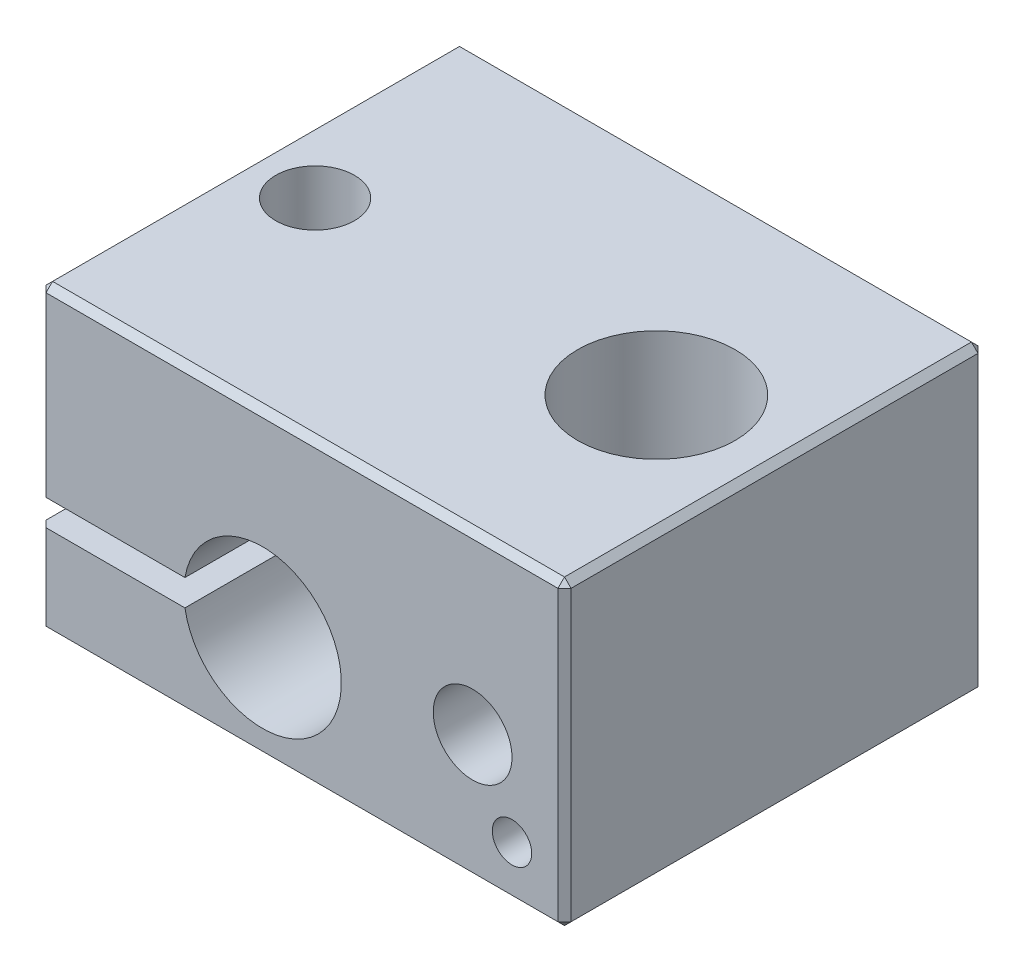
ISO-10303-21;
HEADER;
FILE_DESCRIPTION(('STEP AP214'),'2;1');
FILE_NAME('part.step','',(''),(''),'','','');
FILE_SCHEMA(('AUTOMOTIVE_DESIGN { 1 0 10303 214 1 1 1 1 }'));
ENDSEC;
DATA;
#1=APPLICATION_CONTEXT('core data for automotive mechanical design processes');
#2=APPLICATION_PROTOCOL_DEFINITION('international standard','automotive_design',2000,#1);
#3=PRODUCT_CONTEXT('',#1,'mechanical');
#4=PRODUCT('Part','Part','',(#3));
#5=PRODUCT_RELATED_PRODUCT_CATEGORY('part','',(#4));
#6=PRODUCT_DEFINITION_FORMATION('','',#4);
#7=PRODUCT_DEFINITION_CONTEXT('part definition',#1,'design');
#8=PRODUCT_DEFINITION('design','',#6,#7);
#9=PRODUCT_DEFINITION_SHAPE('','',#8);
#10=(LENGTH_UNIT() NAMED_UNIT(*) SI_UNIT(.MILLI.,.METRE.));
#11=(NAMED_UNIT(*) PLANE_ANGLE_UNIT() SI_UNIT($,.RADIAN.));
#12=(NAMED_UNIT(*) SI_UNIT($,.STERADIAN.) SOLID_ANGLE_UNIT());
#13=UNCERTAINTY_MEASURE_WITH_UNIT(LENGTH_MEASURE(1.E-05),#10,'distance_accuracy_value','');
#14=(GEOMETRIC_REPRESENTATION_CONTEXT(3) GLOBAL_UNCERTAINTY_ASSIGNED_CONTEXT((#13)) GLOBAL_UNIT_ASSIGNED_CONTEXT((#10,
#11,#12)) REPRESENTATION_CONTEXT('',''));
#15=CARTESIAN_POINT('',(0.,0.,0.));
#16=DIRECTION('',(0.,0.,1.));
#17=DIRECTION('',(1.,0.,0.));
#18=AXIS2_PLACEMENT_3D('',#15,#16,#17);
#19=CARTESIAN_POINT('',(-9.99999999999999,11.5,7.99999999999999));
#20=DIRECTION('',(-1.,0.,0.));
#21=DIRECTION('',(0.,0.,1.));
#22=AXIS2_PLACEMENT_3D('',#19,#20,#21);
#23=PLANE('',#22);
#24=DIRECTION('',(0.,0.,-1.));
#25=VECTOR('',#24,1.);
#26=CARTESIAN_POINT('',(-10.,3.5,7.99999999999999));
#27=LINE('',#26,#25);
#28=CARTESIAN_POINT('',(-10.,3.5,7.74999999999999));
#29=VERTEX_POINT('',#28);
#30=CARTESIAN_POINT('',(-10.,3.5,-7.75000000000001));
#31=VERTEX_POINT('',#30);
#32=EDGE_CURVE('E193',#29,#31,#27,.T.);
#33=ORIENTED_EDGE('',*,*,#32,.T.);
#34=DIRECTION('',(0.,-1.,0.));
#35=VECTOR('',#34,1.);
#36=CARTESIAN_POINT('',(-10.,11.5,-7.75000000000001));
#37=LINE('',#36,#35);
#38=CARTESIAN_POINT('',(-10.,0.250000000000004,-7.75000000000001));
#39=VERTEX_POINT('',#38);
#40=EDGE_CURVE('E209',#31,#39,#37,.T.);
#41=ORIENTED_EDGE('',*,*,#40,.T.);
#42=DIRECTION('',(0.,0.,1.));
#43=VECTOR('',#42,1.);
#44=CARTESIAN_POINT('',(-9.99999999999999,0.250000000000004,7.99999999999999));
#45=LINE('',#44,#43);
#46=CARTESIAN_POINT('',(-9.99999999999999,0.250000000000004,7.74999999999999));
#47=VERTEX_POINT('',#46);
#48=EDGE_CURVE('E207',#39,#47,#45,.T.);
#49=ORIENTED_EDGE('',*,*,#48,.T.);
#50=DIRECTION('',(0.,1.,0.));
#51=VECTOR('',#50,1.);
#52=CARTESIAN_POINT('',(-9.99999999999999,11.5,7.74999999999999));
#53=LINE('',#52,#51);
#54=EDGE_CURVE('E174',#47,#29,#53,.T.);
#55=ORIENTED_EDGE('',*,*,#54,.T.);
#56=EDGE_LOOP('',(#33,#41,#49,#55));
#57=FACE_BOUND('',#56,.T.);
#58=ADVANCED_FACE('F35',(#57),#23,.T.);
#59=CARTESIAN_POINT('',(-10.,11.5,-8.00000000000001));
#60=DIRECTION('',(0.,0.,-1.));
#61=DIRECTION('',(-1.,0.,0.));
#62=AXIS2_PLACEMENT_3D('',#59,#60,#61);
#63=PLANE('',#62);
#64=DIRECTION('',(-1.,0.,0.));
#65=VECTOR('',#64,1.);
#66=CARTESIAN_POINT('',(-10.,0.250000000000004,-8.00000000000001));
#67=LINE('',#66,#65);
#68=CARTESIAN_POINT('',(9.75,0.250000000000004,-8.00000000000001));
#69=VERTEX_POINT('',#68);
#70=CARTESIAN_POINT('',(-9.74999999999999,0.250000000000004,-8.00000000000001));
#71=VERTEX_POINT('',#70);
#72=EDGE_CURVE('E218',#69,#71,#67,.T.);
#73=ORIENTED_EDGE('',*,*,#72,.T.);
#74=DIRECTION('',(0.,1.,0.));
#75=VECTOR('',#74,1.);
#76=CARTESIAN_POINT('',(-9.74999999999999,11.5,-8.00000000000001));
#77=LINE('',#76,#75);
#78=CARTESIAN_POINT('',(-9.74999999999999,3.5,-8.00000000000001));
#79=VERTEX_POINT('',#78);
#80=EDGE_CURVE('E220',#71,#79,#77,.T.);
#81=ORIENTED_EDGE('',*,*,#80,.T.);
#82=DIRECTION('',(-1.,0.,0.));
#83=VECTOR('',#82,1.);
#84=CARTESIAN_POINT('',(-4.4580398915498,3.5,-8.00000000000001));
#85=LINE('',#84,#83);
#86=CARTESIAN_POINT('',(-4.4580398915498,3.5,-8.00000000000001));
#87=VERTEX_POINT('',#86);
#88=EDGE_CURVE('E195',#87,#79,#85,.T.);
#89=ORIENTED_EDGE('',*,*,#88,.F.);
#90=CARTESIAN_POINT('',(-1.49999999999999,4.,-8.00000000000001));
#91=DIRECTION('',(0.,0.,1.));
#92=DIRECTION('',(1.,0.,0.));
#93=AXIS2_PLACEMENT_3D('',#90,#91,#92);
#94=CIRCLE('',#93,3.);
#95=CARTESIAN_POINT('',(-4.4580398915498,4.5,-8.00000000000001));
#96=VERTEX_POINT('',#95);
#97=EDGE_CURVE('E169',#87,#96,#94,.T.);
#98=ORIENTED_EDGE('',*,*,#97,.T.);
#99=DIRECTION('',(1.,0.,0.));
#100=VECTOR('',#99,1.);
#101=CARTESIAN_POINT('',(-10.,4.5,-8.00000000000001));
#102=LINE('',#101,#100);
#103=CARTESIAN_POINT('',(-9.74999999999999,4.5,-8.00000000000001));
#104=VERTEX_POINT('',#103);
#105=EDGE_CURVE('E191',#104,#96,#102,.T.);
#106=ORIENTED_EDGE('',*,*,#105,.F.);
#107=DIRECTION('',(0.,1.,0.));
#108=VECTOR('',#107,1.);
#109=CARTESIAN_POINT('',(-9.74999999999999,11.5,-8.00000000000001));
#110=LINE('',#109,#108);
#111=CARTESIAN_POINT('',(-9.74999999999999,11.25,-8.00000000000001));
#112=VERTEX_POINT('',#111);
#113=EDGE_CURVE('E216',#104,#112,#110,.T.);
#114=ORIENTED_EDGE('',*,*,#113,.T.);
#115=DIRECTION('',(1.,0.,0.));
#116=VECTOR('',#115,1.);
#117=CARTESIAN_POINT('',(10.,11.25,-8.00000000000001));
#118=LINE('',#117,#116);
#119=CARTESIAN_POINT('',(9.75,11.25,-8.00000000000001));
#120=VERTEX_POINT('',#119);
#121=EDGE_CURVE('E212',#112,#120,#118,.T.);
#122=ORIENTED_EDGE('',*,*,#121,.T.);
#123=DIRECTION('',(0.,-1.,0.));
#124=VECTOR('',#123,1.);
#125=CARTESIAN_POINT('',(9.75,11.5,-8.00000000000001));
#126=LINE('',#125,#124);
#127=EDGE_CURVE('E214',#120,#69,#126,.T.);
#128=ORIENTED_EDGE('',*,*,#127,.T.);
#129=EDGE_LOOP('',(#73,#81,#89,#98,#106,#114,#122,#128));
#130=FACE_BOUND('',#129,.T.);
#131=ADVANCED_FACE('F395',(#130),#63,.T.);
#132=DIRECTION('',(0.,0.,-1.));
#133=VECTOR('',#132,1.);
#134=CARTESIAN_POINT('',(-10.,11.25,-8.00000000000001));
#135=LINE('',#134,#133);
#136=CARTESIAN_POINT('',(-9.99999999999999,11.25,7.74999999999999));
#137=VERTEX_POINT('',#136);
#138=CARTESIAN_POINT('',(-10.,11.25,-7.75000000000001));
#139=VERTEX_POINT('',#138);
#140=EDGE_CURVE('E255',#137,#139,#135,.T.);
#141=ORIENTED_EDGE('',*,*,#140,.T.);
#142=DIRECTION('',(0.,-1.,0.));
#143=VECTOR('',#142,1.);
#144=CARTESIAN_POINT('',(-10.,11.5,-7.75000000000001));
#145=LINE('',#144,#143);
#146=CARTESIAN_POINT('',(-10.,4.5,-7.75000000000001));
#147=VERTEX_POINT('',#146);
#148=EDGE_CURVE('E257',#139,#147,#145,.T.);
#149=ORIENTED_EDGE('',*,*,#148,.T.);
#150=DIRECTION('',(0.,0.,-1.));
#151=VECTOR('',#150,1.);
#152=CARTESIAN_POINT('',(-10.,4.5,7.99999999999999));
#153=LINE('',#152,#151);
#154=CARTESIAN_POINT('',(-10.,4.5,7.74999999999999));
#155=VERTEX_POINT('',#154);
#156=EDGE_CURVE('E201',#155,#147,#153,.T.);
#157=ORIENTED_EDGE('',*,*,#156,.F.);
#158=DIRECTION('',(0.,1.,0.));
#159=VECTOR('',#158,1.);
#160=CARTESIAN_POINT('',(-9.99999999999999,11.5,7.74999999999999));
#161=LINE('',#160,#159);
#162=EDGE_CURVE('E253',#155,#137,#161,.T.);
#163=ORIENTED_EDGE('',*,*,#162,.T.);
#164=EDGE_LOOP('',(#141,#149,#157,#163));
#165=FACE_BOUND('',#164,.T.);
#166=ADVANCED_FACE('F400',(#165),#23,.T.);
#167=CARTESIAN_POINT('',(10.,11.5,7.99999999999999));
#168=DIRECTION('',(0.,0.,1.));
#169=DIRECTION('',(1.,0.,0.));
#170=AXIS2_PLACEMENT_3D('',#167,#168,#169);
#171=PLANE('',#170);
#172=DIRECTION('',(-1.,0.,0.));
#173=VECTOR('',#172,1.);
#174=CARTESIAN_POINT('',(-4.4580398915498,3.5,7.99999999999999));
#175=LINE('',#174,#173);
#176=CARTESIAN_POINT('',(-4.4580398915498,3.5,7.99999999999999));
#177=VERTEX_POINT('',#176);
#178=CARTESIAN_POINT('',(-9.74999999999999,3.5,7.99999999999999));
#179=VERTEX_POINT('',#178);
#180=EDGE_CURVE('E181',#177,#179,#175,.T.);
#181=ORIENTED_EDGE('',*,*,#180,.T.);
#182=DIRECTION('',(0.,-1.,0.));
#183=VECTOR('',#182,1.);
#184=CARTESIAN_POINT('',(-9.75,11.5,7.99999999999999));
#185=LINE('',#184,#183);
#186=CARTESIAN_POINT('',(-9.75,0.250000000000004,7.99999999999999));
#187=VERTEX_POINT('',#186);
#188=EDGE_CURVE('E242',#179,#187,#185,.T.);
#189=ORIENTED_EDGE('',*,*,#188,.T.);
#190=DIRECTION('',(1.,0.,0.));
#191=VECTOR('',#190,1.);
#192=CARTESIAN_POINT('',(10.,0.250000000000004,7.99999999999999));
#193=LINE('',#192,#191);
#194=CARTESIAN_POINT('',(9.75,0.250000000000004,7.99999999999999));
#195=VERTEX_POINT('',#194);
#196=EDGE_CURVE('E240',#187,#195,#193,.T.);
#197=ORIENTED_EDGE('',*,*,#196,.T.);
#198=DIRECTION('',(0.,1.,0.));
#199=VECTOR('',#198,1.);
#200=CARTESIAN_POINT('',(9.75,11.5,7.99999999999999));
#201=LINE('',#200,#199);
#202=CARTESIAN_POINT('',(9.75,11.25,7.99999999999999));
#203=VERTEX_POINT('',#202);
#204=EDGE_CURVE('E236',#195,#203,#201,.T.);
#205=ORIENTED_EDGE('',*,*,#204,.T.);
#206=DIRECTION('',(-1.,0.,0.));
#207=VECTOR('',#206,1.);
#208=CARTESIAN_POINT('',(-9.99999999999999,11.25,7.99999999999999));
#209=LINE('',#208,#207);
#210=CARTESIAN_POINT('',(-9.75,11.25,7.99999999999999));
#211=VERTEX_POINT('',#210);
#212=EDGE_CURVE('E234',#203,#211,#209,.T.);
#213=ORIENTED_EDGE('',*,*,#212,.T.);
#214=DIRECTION('',(0.,-1.,0.));
#215=VECTOR('',#214,1.);
#216=CARTESIAN_POINT('',(-9.75,11.5,7.99999999999999));
#217=LINE('',#216,#215);
#218=CARTESIAN_POINT('',(-9.75,4.5,7.99999999999999));
#219=VERTEX_POINT('',#218);
#220=EDGE_CURVE('E238',#211,#219,#217,.T.);
#221=ORIENTED_EDGE('',*,*,#220,.T.);
#222=DIRECTION('',(1.,0.,0.));
#223=VECTOR('',#222,1.);
#224=CARTESIAN_POINT('',(-10.,4.5,7.99999999999999));
#225=LINE('',#224,#223);
#226=CARTESIAN_POINT('',(-4.4580398915498,4.5,7.99999999999999));
#227=VERTEX_POINT('',#226);
#228=EDGE_CURVE('E184',#219,#227,#225,.T.);
#229=ORIENTED_EDGE('',*,*,#228,.T.);
#230=CARTESIAN_POINT('',(-1.49999999999999,4.,7.99999999999999));
#231=DIRECTION('',(0.,0.,1.));
#232=DIRECTION('',(1.,0.,0.));
#233=AXIS2_PLACEMENT_3D('',#230,#231,#232);
#234=CIRCLE('',#233,3.);
#235=EDGE_CURVE('E166',#177,#227,#234,.T.);
#236=ORIENTED_EDGE('',*,*,#235,.F.);
#237=EDGE_LOOP('',(#181,#189,#197,#205,#213,#221,#229,#236));
#238=FACE_BOUND('',#237,.T.);
#239=CARTESIAN_POINT('',(8.00000000000001,2.,7.99999999999999));
#240=DIRECTION('',(0.,0.,1.));
#241=DIRECTION('',(1.,0.,0.));
#242=AXIS2_PLACEMENT_3D('',#239,#240,#241);
#243=CIRCLE('',#242,0.74999999999999);
#244=CARTESIAN_POINT('',(8.75,2.,7.99999999999999));
#245=VERTEX_POINT('',#244);
#246=EDGE_CURVE('E332',#245,#245,#243,.T.);
#247=ORIENTED_EDGE('',*,*,#246,.F.);
#248=EDGE_LOOP('',(#247));
#249=FACE_BOUND('',#248,.T.);
#250=CARTESIAN_POINT('',(6.50000000000001,4.8,7.99999999999999));
#251=DIRECTION('',(0.,0.,1.));
#252=DIRECTION('',(1.,0.,0.));
#253=AXIS2_PLACEMENT_3D('',#250,#251,#252);
#254=CIRCLE('',#253,1.49999999999999);
#255=CARTESIAN_POINT('',(8.,4.8,7.99999999999999));
#256=VERTEX_POINT('',#255);
#257=EDGE_CURVE('E342',#256,#256,#254,.T.);
#258=ORIENTED_EDGE('',*,*,#257,.F.);
#259=EDGE_LOOP('',(#258));
#260=FACE_BOUND('',#259,.T.);
#261=ADVANCED_FACE('F179',(#238,#249,#260),#171,.T.);
#262=CARTESIAN_POINT('',(10.,11.5,-8.00000000000001));
#263=DIRECTION('',(1.,0.,0.));
#264=DIRECTION('',(0.,0.,-1.));
#265=AXIS2_PLACEMENT_3D('',#262,#263,#264);
#266=PLANE('',#265);
#267=DIRECTION('',(0.,-1.,0.));
#268=VECTOR('',#267,1.);
#269=CARTESIAN_POINT('',(10.,11.5,7.75));
#270=LINE('',#269,#268);
#271=CARTESIAN_POINT('',(10.,11.25,7.75));
#272=VERTEX_POINT('',#271);
#273=CARTESIAN_POINT('',(10.,0.249999999999997,7.75));
#274=VERTEX_POINT('',#273);
#275=EDGE_CURVE('E246',#272,#274,#270,.T.);
#276=ORIENTED_EDGE('',*,*,#275,.T.);
#277=DIRECTION('',(0.,0.,-1.));
#278=VECTOR('',#277,1.);
#279=CARTESIAN_POINT('',(10.,0.249999999999997,-8.00000000000001));
#280=LINE('',#279,#278);
#281=CARTESIAN_POINT('',(10.,0.249999999999997,-7.75000000000001));
#282=VERTEX_POINT('',#281);
#283=EDGE_CURVE('E250',#274,#282,#280,.T.);
#284=ORIENTED_EDGE('',*,*,#283,.T.);
#285=DIRECTION('',(0.,1.,0.));
#286=VECTOR('',#285,1.);
#287=CARTESIAN_POINT('',(10.,11.5,-7.75000000000001));
#288=LINE('',#287,#286);
#289=CARTESIAN_POINT('',(10.,11.25,-7.75000000000001));
#290=VERTEX_POINT('',#289);
#291=EDGE_CURVE('E248',#282,#290,#288,.T.);
#292=ORIENTED_EDGE('',*,*,#291,.T.);
#293=DIRECTION('',(0.,0.,1.));
#294=VECTOR('',#293,1.);
#295=CARTESIAN_POINT('',(10.,11.25,7.99999999999999));
#296=LINE('',#295,#294);
#297=EDGE_CURVE('E244',#290,#272,#296,.T.);
#298=ORIENTED_EDGE('',*,*,#297,.T.);
#299=EDGE_LOOP('',(#276,#284,#292,#298));
#300=FACE_BOUND('',#299,.T.);
#301=ADVANCED_FACE('F469',(#300),#266,.T.);
#302=CARTESIAN_POINT('',(0.,11.5,0.));
#303=DIRECTION('',(0.,-1.,0.));
#304=DIRECTION('',(0.,0.,-1.));
#305=AXIS2_PLACEMENT_3D('',#302,#303,#304);
#306=PLANE('',#305);
#307=DIRECTION('',(-1.,0.,0.));
#308=VECTOR('',#307,1.);
#309=CARTESIAN_POINT('',(-10.,11.5,-7.75));
#310=LINE('',#309,#308);
#311=CARTESIAN_POINT('',(9.75,11.5,-7.75));
#312=VERTEX_POINT('',#311);
#313=CARTESIAN_POINT('',(-9.74999999999999,11.5,-7.75));
#314=VERTEX_POINT('',#313);
#315=EDGE_CURVE('E44',#312,#314,#310,.T.);
#316=ORIENTED_EDGE('',*,*,#315,.T.);
#317=DIRECTION('',(0.,0.,1.));
#318=VECTOR('',#317,1.);
#319=CARTESIAN_POINT('',(-9.74999999999999,11.5,7.99999999999999));
#320=LINE('',#319,#318);
#321=CARTESIAN_POINT('',(-9.74999999999999,11.5,7.74999999999999));
#322=VERTEX_POINT('',#321);
#323=EDGE_CURVE('E11',#314,#322,#320,.T.);
#324=ORIENTED_EDGE('',*,*,#323,.T.);
#325=DIRECTION('',(1.,0.,0.));
#326=VECTOR('',#325,1.);
#327=CARTESIAN_POINT('',(10.,11.5,7.74999999999999));
#328=LINE('',#327,#326);
#329=CARTESIAN_POINT('',(9.75,11.5,7.74999999999999));
#330=VERTEX_POINT('',#329);
#331=EDGE_CURVE('E58',#322,#330,#328,.T.);
#332=ORIENTED_EDGE('',*,*,#331,.T.);
#333=DIRECTION('',(0.,0.,-1.));
#334=VECTOR('',#333,1.);
#335=CARTESIAN_POINT('',(9.75,11.5,-8.00000000000001));
#336=LINE('',#335,#334);
#337=EDGE_CURVE('E263',#330,#312,#336,.T.);
#338=ORIENTED_EDGE('',*,*,#337,.T.);
#339=EDGE_LOOP('',(#316,#324,#332,#338));
#340=FACE_BOUND('',#339,.T.);
#341=CARTESIAN_POINT('',(5.50000000000001,11.5,0.));
#342=DIRECTION('',(0.,-1.,0.));
#343=DIRECTION('',(0.,0.,-1.));
#344=AXIS2_PLACEMENT_3D('',#341,#342,#343);
#345=CIRCLE('',#344,2.99999999999999);
#346=CARTESIAN_POINT('',(5.50000000000001,11.5,-2.99999999999999));
#347=VERTEX_POINT('',#346);
#348=EDGE_CURVE('E359',#347,#347,#345,.T.);
#349=ORIENTED_EDGE('',*,*,#348,.T.);
#350=EDGE_LOOP('',(#349));
#351=FACE_BOUND('',#350,.T.);
#352=CARTESIAN_POINT('',(-7.49999999999999,11.5,0.));
#353=DIRECTION('',(0.,-1.,0.));
#354=DIRECTION('',(0.,0.,-1.));
#355=AXIS2_PLACEMENT_3D('',#352,#353,#354);
#356=CIRCLE('',#355,1.49999999999999);
#357=CARTESIAN_POINT('',(-7.49999999999999,11.5,-1.49999999999999));
#358=VERTEX_POINT('',#357);
#359=EDGE_CURVE('E185',#358,#358,#356,.T.);
#360=ORIENTED_EDGE('',*,*,#359,.T.);
#361=EDGE_LOOP('',(#360));
#362=FACE_BOUND('',#361,.T.);
#363=ADVANCED_FACE('F368',(#340,#351,#362),#306,.F.);
#364=CARTESIAN_POINT('',(0.,0.,0.));
#365=DIRECTION('',(0.,-1.,0.));
#366=DIRECTION('',(0.,0.,-1.));
#367=AXIS2_PLACEMENT_3D('',#364,#365,#366);
#368=PLANE('',#367);
#369=DIRECTION('',(-1.,0.,0.));
#370=VECTOR('',#369,1.);
#371=CARTESIAN_POINT('',(0.,0.,7.75));
#372=LINE('',#371,#370);
#373=CARTESIAN_POINT('',(9.75,0.,7.75));
#374=VERTEX_POINT('',#373);
#375=CARTESIAN_POINT('',(-9.75,0.,7.75));
#376=VERTEX_POINT('',#375);
#377=EDGE_CURVE('E227',#374,#376,#372,.T.);
#378=ORIENTED_EDGE('',*,*,#377,.T.);
#379=DIRECTION('',(0.,0.,-1.));
#380=VECTOR('',#379,1.);
#381=CARTESIAN_POINT('',(-9.75,0.,0.));
#382=LINE('',#381,#380);
#383=CARTESIAN_POINT('',(-9.75,0.,-7.75000000000001));
#384=VERTEX_POINT('',#383);
#385=EDGE_CURVE('E231',#376,#384,#382,.T.);
#386=ORIENTED_EDGE('',*,*,#385,.T.);
#387=DIRECTION('',(1.,0.,0.));
#388=VECTOR('',#387,1.);
#389=CARTESIAN_POINT('',(0.,0.,-7.75000000000001));
#390=LINE('',#389,#388);
#391=CARTESIAN_POINT('',(9.75,0.,-7.75000000000001));
#392=VERTEX_POINT('',#391);
#393=EDGE_CURVE('E229',#384,#392,#390,.T.);
#394=ORIENTED_EDGE('',*,*,#393,.T.);
#395=DIRECTION('',(0.,0.,1.));
#396=VECTOR('',#395,1.);
#397=CARTESIAN_POINT('',(9.75,0.,0.));
#398=LINE('',#397,#396);
#399=EDGE_CURVE('E225',#392,#374,#398,.T.);
#400=ORIENTED_EDGE('',*,*,#399,.T.);
#401=EDGE_LOOP('',(#378,#386,#394,#400));
#402=FACE_BOUND('',#401,.T.);
#403=CARTESIAN_POINT('',(-7.49999999999999,0.,0.));
#404=DIRECTION('',(0.,1.,0.));
#405=DIRECTION('',(0.,0.,1.));
#406=AXIS2_PLACEMENT_3D('',#403,#404,#405);
#407=CIRCLE('',#406,1.49999999999999);
#408=CARTESIAN_POINT('',(-7.49999999999999,0.,1.49999999999998));
#409=VERTEX_POINT('',#408);
#410=EDGE_CURVE('E353',#409,#409,#407,.T.);
#411=ORIENTED_EDGE('',*,*,#410,.T.);
#412=EDGE_LOOP('',(#411));
#413=FACE_BOUND('',#412,.T.);
#414=CARTESIAN_POINT('',(5.50000000000001,0.,0.));
#415=DIRECTION('',(0.,-1.,0.));
#416=DIRECTION('',(0.,0.,-1.));
#417=AXIS2_PLACEMENT_3D('',#414,#415,#416);
#418=CIRCLE('',#417,2.99999999999999);
#419=CARTESIAN_POINT('',(5.50000000000001,0.,-3.));
#420=VERTEX_POINT('',#419);
#421=EDGE_CURVE('E356',#420,#420,#418,.T.);
#422=ORIENTED_EDGE('',*,*,#421,.F.);
#423=EDGE_LOOP('',(#422));
#424=FACE_BOUND('',#423,.T.);
#425=ADVANCED_FACE('F468',(#402,#413,#424),#368,.T.);
#426=CARTESIAN_POINT('',(-4.4580398915498,3.5,7.99999999999999));
#427=DIRECTION('',(0.,-1.,0.));
#428=DIRECTION('',(1.,0.,0.));
#429=AXIS2_PLACEMENT_3D('',#426,#427,#428);
#430=PLANE('',#429);
#431=CARTESIAN_POINT('',(-7.49999999999999,3.5,0.));
#432=DIRECTION('',(0.,1.,0.));
#433=DIRECTION('',(0.,0.,1.));
#434=AXIS2_PLACEMENT_3D('',#431,#432,#433);
#435=CIRCLE('',#434,1.49999999999999);
#436=CARTESIAN_POINT('',(-7.49999999999999,3.5,1.49999999999998));
#437=VERTEX_POINT('',#436);
#438=EDGE_CURVE('E350',#437,#437,#435,.T.);
#439=ORIENTED_EDGE('',*,*,#438,.F.);
#440=EDGE_LOOP('',(#439));
#441=FACE_BOUND('',#440,.T.);
#442=ORIENTED_EDGE('',*,*,#88,.T.);
#443=DIRECTION('',(0.707106781186557,0.,-0.707106781186538));
#444=VECTOR('',#443,1.);
#445=CARTESIAN_POINT('',(-10.,3.5,-7.75000000000001));
#446=LINE('',#445,#444);
#447=EDGE_CURVE('E223',#79,#31,#446,.F.);
#448=ORIENTED_EDGE('',*,*,#447,.T.);
#449=ORIENTED_EDGE('',*,*,#32,.F.);
#450=DIRECTION('',(-0.70710678118654,0.,-0.707106781186555));
#451=VECTOR('',#450,1.);
#452=CARTESIAN_POINT('',(-9.75,3.5,7.99999999999999));
#453=LINE('',#452,#451);
#454=EDGE_CURVE('E190',#29,#179,#453,.F.);
#455=ORIENTED_EDGE('',*,*,#454,.T.);
#456=ORIENTED_EDGE('',*,*,#180,.F.);
#457=DIRECTION('',(0.,0.,-1.));
#458=VECTOR('',#457,1.);
#459=CARTESIAN_POINT('',(-4.4580398915498,3.5,7.99999999999999));
#460=LINE('',#459,#458);
#461=EDGE_CURVE('E162',#177,#87,#460,.T.);
#462=ORIENTED_EDGE('',*,*,#461,.T.);
#463=EDGE_LOOP('',(#442,#448,#449,#455,#456,#462));
#464=FACE_BOUND('',#463,.T.);
#465=ADVANCED_FACE('F187',(#441,#464),#430,.F.);
#466=CARTESIAN_POINT('',(-10.,4.5,7.99999999999999));
#467=DIRECTION('',(0.,1.,0.));
#468=DIRECTION('',(0.,0.,1.));
#469=AXIS2_PLACEMENT_3D('',#466,#467,#468);
#470=PLANE('',#469);
#471=CARTESIAN_POINT('',(-7.49999999999999,4.5,0.));
#472=DIRECTION('',(0.,-1.,0.));
#473=DIRECTION('',(0.,0.,-1.));
#474=AXIS2_PLACEMENT_3D('',#471,#472,#473);
#475=CIRCLE('',#474,1.49999999999999);
#476=CARTESIAN_POINT('',(-7.49999999999999,4.5,-1.49999999999999));
#477=VERTEX_POINT('',#476);
#478=EDGE_CURVE('E362',#477,#477,#475,.T.);
#479=ORIENTED_EDGE('',*,*,#478,.F.);
#480=EDGE_LOOP('',(#479));
#481=FACE_BOUND('',#480,.T.);
#482=ORIENTED_EDGE('',*,*,#156,.T.);
#483=DIRECTION('',(-0.707106781186557,0.,0.707106781186538));
#484=VECTOR('',#483,1.);
#485=CARTESIAN_POINT('',(-10.,4.5,-7.75000000000001));
#486=LINE('',#485,#484);
#487=EDGE_CURVE('E261',#147,#104,#486,.F.);
#488=ORIENTED_EDGE('',*,*,#487,.T.);
#489=ORIENTED_EDGE('',*,*,#105,.T.);
#490=DIRECTION('',(0.,0.,-1.));
#491=VECTOR('',#490,1.);
#492=CARTESIAN_POINT('',(-4.4580398915498,4.5,7.99999999999999));
#493=LINE('',#492,#491);
#494=EDGE_CURVE('E175',#227,#96,#493,.T.);
#495=ORIENTED_EDGE('',*,*,#494,.F.);
#496=ORIENTED_EDGE('',*,*,#228,.F.);
#497=DIRECTION('',(0.70710678118654,0.,0.707106781186555));
#498=VECTOR('',#497,1.);
#499=CARTESIAN_POINT('',(-9.75,4.5,7.99999999999999));
#500=LINE('',#499,#498);
#501=EDGE_CURVE('E259',#219,#155,#500,.F.);
#502=ORIENTED_EDGE('',*,*,#501,.T.);
#503=EDGE_LOOP('',(#482,#488,#489,#495,#496,#502));
#504=FACE_BOUND('',#503,.T.);
#505=ADVANCED_FACE('F377',(#481,#504),#470,.F.);
#506=CARTESIAN_POINT('',(-1.49999999999999,4.,-8.00000000000001));
#507=DIRECTION('',(0.,0.,1.));
#508=DIRECTION('',(1.,0.,0.));
#509=AXIS2_PLACEMENT_3D('',#506,#507,#508);
#510=CYLINDRICAL_SURFACE('',#509,3.);
#511=ORIENTED_EDGE('',*,*,#235,.T.);
#512=ORIENTED_EDGE('',*,*,#494,.T.);
#513=ORIENTED_EDGE('',*,*,#97,.F.);
#514=ORIENTED_EDGE('',*,*,#461,.F.);
#515=EDGE_LOOP('',(#511,#512,#513,#514));
#516=FACE_BOUND('',#515,.T.);
#517=ADVANCED_FACE('F164',(#516),#510,.F.);
#518=CARTESIAN_POINT('',(-7.49999999999999,4.5,0.));
#519=DIRECTION('',(0.,-1.,0.));
#520=DIRECTION('',(0.,0.,-1.));
#521=AXIS2_PLACEMENT_3D('',#518,#519,#520);
#522=CYLINDRICAL_SURFACE('',#521,1.49999999999999);
#523=ORIENTED_EDGE('',*,*,#359,.F.);
#524=EDGE_LOOP('',(#523));
#525=FACE_BOUND('',#524,.T.);
#526=ORIENTED_EDGE('',*,*,#478,.T.);
#527=EDGE_LOOP('',(#526));
#528=FACE_BOUND('',#527,.T.);
#529=ADVANCED_FACE('F370',(#525,#528),#522,.F.);
#530=CARTESIAN_POINT('',(5.50000000000001,0.,0.));
#531=DIRECTION('',(0.,-1.,0.));
#532=DIRECTION('',(0.,0.,-1.));
#533=AXIS2_PLACEMENT_3D('',#530,#531,#532);
#534=CYLINDRICAL_SURFACE('',#533,2.99999999999999);
#535=ORIENTED_EDGE('',*,*,#348,.F.);
#536=EDGE_LOOP('',(#535));
#537=FACE_BOUND('',#536,.T.);
#538=ORIENTED_EDGE('',*,*,#421,.T.);
#539=EDGE_LOOP('',(#538));
#540=FACE_BOUND('',#539,.T.);
#541=ADVANCED_FACE('F373',(#537,#540),#534,.F.);
#542=CARTESIAN_POINT('',(-7.49999999999999,3.5,0.));
#543=DIRECTION('',(0.,1.,0.));
#544=DIRECTION('',(0.,0.,1.));
#545=AXIS2_PLACEMENT_3D('',#542,#543,#544);
#546=CYLINDRICAL_SURFACE('',#545,1.49999999999999);
#547=ORIENTED_EDGE('',*,*,#410,.F.);
#548=EDGE_LOOP('',(#547));
#549=FACE_BOUND('',#548,.T.);
#550=ORIENTED_EDGE('',*,*,#438,.T.);
#551=EDGE_LOOP('',(#550));
#552=FACE_BOUND('',#551,.T.);
#553=ADVANCED_FACE('F475',(#549,#552),#546,.F.);
#554=CARTESIAN_POINT('',(6.50000000000001,4.8,4.49999999999999));
#555=DIRECTION('',(0.,0.,-1.));
#556=DIRECTION('',(-1.,0.,0.));
#557=AXIS2_PLACEMENT_3D('',#554,#555,#556);
#558=PLANE('',#557);
#559=CARTESIAN_POINT('',(6.50000000000001,4.8,4.49999999999999));
#560=DIRECTION('',(0.,0.,1.));
#561=DIRECTION('',(1.,0.,0.));
#562=AXIS2_PLACEMENT_3D('',#559,#560,#561);
#563=CIRCLE('',#562,1.49999999999999);
#564=CARTESIAN_POINT('',(7.99999999999999,4.8,4.49999999999999));
#565=VERTEX_POINT('',#564);
#566=EDGE_CURVE('E347',#565,#565,#563,.T.);
#567=ORIENTED_EDGE('',*,*,#566,.T.);
#568=EDGE_LOOP('',(#567));
#569=FACE_BOUND('',#568,.T.);
#570=ADVANCED_FACE('F572',(#569),#558,.F.);
#571=CARTESIAN_POINT('',(6.50000000000001,4.8,7.99999999999999));
#572=DIRECTION('',(0.,0.,1.));
#573=DIRECTION('',(1.,0.,0.));
#574=AXIS2_PLACEMENT_3D('',#571,#572,#573);
#575=CYLINDRICAL_SURFACE('',#574,1.49999999999999);
#576=ORIENTED_EDGE('',*,*,#566,.F.);
#577=EDGE_LOOP('',(#576));
#578=FACE_BOUND('',#577,.T.);
#579=ORIENTED_EDGE('',*,*,#257,.T.);
#580=EDGE_LOOP('',(#579));
#581=FACE_BOUND('',#580,.T.);
#582=ADVANCED_FACE('F565',(#578,#581),#575,.F.);
#583=CARTESIAN_POINT('',(8.00000000000001,2.,3.49999999999999));
#584=DIRECTION('',(0.,0.,-1.));
#585=DIRECTION('',(-1.,0.,0.));
#586=AXIS2_PLACEMENT_3D('',#583,#584,#585);
#587=PLANE('',#586);
#588=CARTESIAN_POINT('',(8.00000000000001,2.,3.49999999999999));
#589=DIRECTION('',(0.,0.,1.));
#590=DIRECTION('',(1.,0.,0.));
#591=AXIS2_PLACEMENT_3D('',#588,#589,#590);
#592=CIRCLE('',#591,0.749999999999989);
#593=CARTESIAN_POINT('',(8.75,2.,3.49999999999999));
#594=VERTEX_POINT('',#593);
#595=EDGE_CURVE('E337',#594,#594,#592,.T.);
#596=ORIENTED_EDGE('',*,*,#595,.T.);
#597=EDGE_LOOP('',(#596));
#598=FACE_BOUND('',#597,.T.);
#599=ADVANCED_FACE('F559',(#598),#587,.F.);
#600=CARTESIAN_POINT('',(8.00000000000001,2.,7.99999999999999));
#601=DIRECTION('',(0.,0.,1.));
#602=DIRECTION('',(1.,0.,0.));
#603=AXIS2_PLACEMENT_3D('',#600,#601,#602);
#604=CYLINDRICAL_SURFACE('',#603,0.749999999999989);
#605=ORIENTED_EDGE('',*,*,#595,.F.);
#606=EDGE_LOOP('',(#605));
#607=FACE_BOUND('',#606,.T.);
#608=ORIENTED_EDGE('',*,*,#246,.T.);
#609=EDGE_LOOP('',(#608));
#610=FACE_BOUND('',#609,.T.);
#611=ADVANCED_FACE('F555',(#607,#610),#604,.F.);
#612=CARTESIAN_POINT('',(-9.75,11.5,7.99999999999999));
#613=DIRECTION('',(0.707106781186555,0.,-0.70710678118654));
#614=DIRECTION('',(0.,-1.,0.));
#615=AXIS2_PLACEMENT_3D('',#612,#613,#614);
#616=PLANE('',#615);
#617=DIRECTION('',(-0.70710678118654,0.,-0.707106781186555));
#618=VECTOR('',#617,1.);
#619=CARTESIAN_POINT('',(-9.87499999999999,11.25,7.87499999999999));
#620=LINE('',#619,#618);
#621=EDGE_CURVE('E39',#137,#211,#620,.F.);
#622=ORIENTED_EDGE('',*,*,#621,.F.);
#623=ORIENTED_EDGE('',*,*,#162,.F.);
#624=ORIENTED_EDGE('',*,*,#501,.F.);
#625=ORIENTED_EDGE('',*,*,#220,.F.);
#626=EDGE_LOOP('',(#622,#623,#624,#625));
#627=FACE_BOUND('',#626,.T.);
#628=ADVANCED_FACE('F37',(#627),#616,.F.);
#629=CARTESIAN_POINT('',(-9.74999999999999,11.5,7.74999999999999));
#630=DIRECTION('',(-0.577350269189623,0.577350269189643,0.577350269189611));
#631=DIRECTION('',(-0.70710678118656,-0.707106781186535,0.));
#632=AXIS2_PLACEMENT_3D('',#629,#630,#631);
#633=PLANE('',#632);
#634=DIRECTION('',(-0.707106781186559,-0.707106781186536,0.));
#635=VECTOR('',#634,1.);
#636=CARTESIAN_POINT('',(-9.74999999999999,11.5,7.74999999999999));
#637=LINE('',#636,#635);
#638=EDGE_CURVE('E327',#137,#322,#637,.F.);
#639=ORIENTED_EDGE('',*,*,#638,.F.);
#640=ORIENTED_EDGE('',*,*,#621,.T.);
#641=DIRECTION('',(0.,0.707106781186538,-0.707106781186557));
#642=VECTOR('',#641,1.);
#643=CARTESIAN_POINT('',(-9.74999999999999,11.5,7.74999999999999));
#644=LINE('',#643,#642);
#645=EDGE_CURVE('E329',#322,#211,#644,.F.);
#646=ORIENTED_EDGE('',*,*,#645,.F.);
#647=EDGE_LOOP('',(#639,#640,#646));
#648=FACE_BOUND('',#647,.T.);
#649=ADVANCED_FACE('F550',(#648),#633,.T.);
#650=CARTESIAN_POINT('',(10.,11.25,7.99999999999999));
#651=DIRECTION('',(0.,0.707106781186557,0.707106781186538));
#652=DIRECTION('',(1.,0.,0.));
#653=AXIS2_PLACEMENT_3D('',#650,#651,#652);
#654=PLANE('',#653);
#655=ORIENTED_EDGE('',*,*,#645,.T.);
#656=ORIENTED_EDGE('',*,*,#212,.F.);
#657=DIRECTION('',(0.,-0.707106781186538,0.707106781186557));
#658=VECTOR('',#657,1.);
#659=CARTESIAN_POINT('',(9.75,11.25,7.99999999999999));
#660=LINE('',#659,#658);
#661=EDGE_CURVE('E324',#330,#203,#660,.T.);
#662=ORIENTED_EDGE('',*,*,#661,.F.);
#663=ORIENTED_EDGE('',*,*,#331,.F.);
#664=EDGE_LOOP('',(#655,#656,#662,#663));
#665=FACE_BOUND('',#664,.T.);
#666=ADVANCED_FACE('F458',(#665),#654,.T.);
#667=CARTESIAN_POINT('',(-9.99999999999999,11.25,7.99999999999999));
#668=DIRECTION('',(-0.707106781186537,0.707106781186559,0.));
#669=DIRECTION('',(0.,0.,1.));
#670=AXIS2_PLACEMENT_3D('',#667,#668,#669);
#671=PLANE('',#670);
#672=ORIENTED_EDGE('',*,*,#638,.T.);
#673=ORIENTED_EDGE('',*,*,#323,.F.);
#674=DIRECTION('',(0.707106781186558,0.707106781186537,0.));
#675=VECTOR('',#674,1.);
#676=CARTESIAN_POINT('',(-9.87499999999999,11.375,-7.75000000000001));
#677=LINE('',#676,#675);
#678=EDGE_CURVE('E321',#139,#314,#677,.T.);
#679=ORIENTED_EDGE('',*,*,#678,.F.);
#680=ORIENTED_EDGE('',*,*,#140,.F.);
#681=EDGE_LOOP('',(#672,#673,#679,#680));
#682=FACE_BOUND('',#681,.T.);
#683=ADVANCED_FACE('F403',(#682),#671,.T.);
#684=CARTESIAN_POINT('',(-10.,11.5,-7.75000000000001));
#685=DIRECTION('',(0.707106781186538,0.,0.707106781186557));
#686=DIRECTION('',(0.,-1.,0.));
#687=AXIS2_PLACEMENT_3D('',#684,#685,#686);
#688=PLANE('',#687);
#689=ORIENTED_EDGE('',*,*,#487,.F.);
#690=ORIENTED_EDGE('',*,*,#148,.F.);
#691=DIRECTION('',(0.707106781186557,0.,-0.707106781186538));
#692=VECTOR('',#691,1.);
#693=CARTESIAN_POINT('',(-9.74999999999999,11.25,-8.00000000000001));
#694=LINE('',#693,#692);
#695=EDGE_CURVE('E318',#112,#139,#694,.F.);
#696=ORIENTED_EDGE('',*,*,#695,.F.);
#697=ORIENTED_EDGE('',*,*,#113,.F.);
#698=EDGE_LOOP('',(#689,#690,#696,#697));
#699=FACE_BOUND('',#698,.T.);
#700=ADVANCED_FACE('F390',(#699),#688,.F.);
#701=CARTESIAN_POINT('',(9.75,11.25,7.99999999999999));
#702=DIRECTION('',(0.57735026918961,0.577350269189642,0.577350269189626));
#703=DIRECTION('',(0.,-0.707106781186538,0.707106781186557));
#704=AXIS2_PLACEMENT_3D('',#701,#702,#703);
#705=PLANE('',#704);
#706=DIRECTION('',(-0.707106781186557,0.707106781186538,0.));
#707=VECTOR('',#706,1.);
#708=CARTESIAN_POINT('',(9.87500000000001,11.375,7.74999999999999));
#709=LINE('',#708,#707);
#710=EDGE_CURVE('E312',#330,#272,#709,.F.);
#711=ORIENTED_EDGE('',*,*,#710,.F.);
#712=ORIENTED_EDGE('',*,*,#661,.T.);
#713=DIRECTION('',(-0.707106781186557,0.,0.707106781186538));
#714=VECTOR('',#713,1.);
#715=CARTESIAN_POINT('',(9.75,11.25,7.99999999999999));
#716=LINE('',#715,#714);
#717=EDGE_CURVE('E315',#272,#203,#716,.T.);
#718=ORIENTED_EDGE('',*,*,#717,.F.);
#719=EDGE_LOOP('',(#711,#712,#718));
#720=FACE_BOUND('',#719,.T.);
#721=ADVANCED_FACE('F461',(#720),#705,.T.);
#722=CARTESIAN_POINT('',(-9.74999999999999,11.25,-8.00000000000001));
#723=DIRECTION('',(-0.577350269189608,0.577350269189644,-0.577350269189624));
#724=DIRECTION('',(0.,0.707106781186535,0.70710678118656));
#725=AXIS2_PLACEMENT_3D('',#722,#723,#724);
#726=PLANE('',#725);
#727=ORIENTED_EDGE('',*,*,#695,.T.);
#728=ORIENTED_EDGE('',*,*,#678,.T.);
#729=DIRECTION('',(0.,-0.707106781186538,-0.707106781186557));
#730=VECTOR('',#729,1.);
#731=CARTESIAN_POINT('',(-9.74999999999999,11.25,-8.00000000000001));
#732=LINE('',#731,#730);
#733=EDGE_CURVE('E309',#112,#314,#732,.F.);
#734=ORIENTED_EDGE('',*,*,#733,.F.);
#735=EDGE_LOOP('',(#727,#728,#734));
#736=FACE_BOUND('',#735,.T.);
#737=ADVANCED_FACE('F405',(#736),#726,.T.);
#738=CARTESIAN_POINT('',(10.,11.5,7.75));
#739=DIRECTION('',(-0.707106781186538,0.,-0.707106781186557));
#740=DIRECTION('',(0.,-1.,0.));
#741=AXIS2_PLACEMENT_3D('',#738,#739,#740);
#742=PLANE('',#741);
#743=ORIENTED_EDGE('',*,*,#717,.T.);
#744=ORIENTED_EDGE('',*,*,#204,.F.);
#745=DIRECTION('',(0.707106781186557,0.,-0.707106781186538));
#746=VECTOR('',#745,1.);
#747=CARTESIAN_POINT('',(9.75,0.250000000000004,7.99999999999999));
#748=LINE('',#747,#746);
#749=EDGE_CURVE('E306',#274,#195,#748,.F.);
#750=ORIENTED_EDGE('',*,*,#749,.F.);
#751=ORIENTED_EDGE('',*,*,#275,.F.);
#752=EDGE_LOOP('',(#743,#744,#750,#751));
#753=FACE_BOUND('',#752,.T.);
#754=ADVANCED_FACE('F456',(#753),#742,.F.);
#755=CARTESIAN_POINT('',(10.,11.25,-8.00000000000001));
#756=DIRECTION('',(0.707106781186538,0.707106781186557,0.));
#757=DIRECTION('',(0.,0.,-1.));
#758=AXIS2_PLACEMENT_3D('',#755,#756,#757);
#759=PLANE('',#758);
#760=ORIENTED_EDGE('',*,*,#710,.T.);
#761=ORIENTED_EDGE('',*,*,#297,.F.);
#762=DIRECTION('',(0.707106781186557,-0.707106781186538,0.));
#763=VECTOR('',#762,1.);
#764=CARTESIAN_POINT('',(10.,11.25,-7.75000000000001));
#765=LINE('',#764,#763);
#766=EDGE_CURVE('E303',#312,#290,#765,.T.);
#767=ORIENTED_EDGE('',*,*,#766,.F.);
#768=ORIENTED_EDGE('',*,*,#337,.F.);
#769=EDGE_LOOP('',(#760,#761,#767,#768));
#770=FACE_BOUND('',#769,.T.);
#771=ADVANCED_FACE('F465',(#770),#759,.T.);
#772=CARTESIAN_POINT('',(-10.,11.25,-8.00000000000001));
#773=DIRECTION('',(0.,0.707106781186557,-0.707106781186538));
#774=DIRECTION('',(-1.,0.,0.));
#775=AXIS2_PLACEMENT_3D('',#772,#773,#774);
#776=PLANE('',#775);
#777=ORIENTED_EDGE('',*,*,#733,.T.);
#778=ORIENTED_EDGE('',*,*,#315,.F.);
#779=DIRECTION('',(0.,0.707106781186538,0.707106781186557));
#780=VECTOR('',#779,1.);
#781=CARTESIAN_POINT('',(9.75,11.375,-7.87500000000001));
#782=LINE('',#781,#780);
#783=EDGE_CURVE('E300',#120,#312,#782,.T.);
#784=ORIENTED_EDGE('',*,*,#783,.F.);
#785=ORIENTED_EDGE('',*,*,#121,.F.);
#786=EDGE_LOOP('',(#777,#778,#784,#785));
#787=FACE_BOUND('',#786,.T.);
#788=ADVANCED_FACE('F407',(#787),#776,.T.);
#789=CARTESIAN_POINT('',(9.75,0.250000000000004,7.99999999999999));
#790=DIRECTION('',(0.57735026918961,-0.577350269189626,0.577350269189642));
#791=DIRECTION('',(0.,-0.707106781186557,-0.707106781186538));
#792=AXIS2_PLACEMENT_3D('',#789,#790,#791);
#793=PLANE('',#792);
#794=DIRECTION('',(-0.707106781186557,-0.707106781186538,0.));
#795=VECTOR('',#794,1.);
#796=CARTESIAN_POINT('',(9.87500000000001,0.124999999999998,7.75));
#797=LINE('',#796,#795);
#798=EDGE_CURVE('E294',#274,#374,#797,.T.);
#799=ORIENTED_EDGE('',*,*,#798,.F.);
#800=ORIENTED_EDGE('',*,*,#749,.T.);
#801=DIRECTION('',(0.,0.707106781186557,0.707106781186538));
#802=VECTOR('',#801,1.);
#803=CARTESIAN_POINT('',(9.75,0.250000000000004,7.99999999999999));
#804=LINE('',#803,#802);
#805=EDGE_CURVE('E297',#374,#195,#804,.T.);
#806=ORIENTED_EDGE('',*,*,#805,.F.);
#807=EDGE_LOOP('',(#799,#800,#806));
#808=FACE_BOUND('',#807,.T.);
#809=ADVANCED_FACE('F451',(#808),#793,.T.);
#810=CARTESIAN_POINT('',(10.,11.25,-7.75000000000001));
#811=DIRECTION('',(0.57735026918961,0.577350269189642,-0.577350269189626));
#812=DIRECTION('',(0.,0.707106781186538,0.707106781186557));
#813=AXIS2_PLACEMENT_3D('',#810,#811,#812);
#814=PLANE('',#813);
#815=ORIENTED_EDGE('',*,*,#783,.T.);
#816=ORIENTED_EDGE('',*,*,#766,.T.);
#817=DIRECTION('',(0.707106781186557,0.,0.707106781186538));
#818=VECTOR('',#817,1.);
#819=CARTESIAN_POINT('',(10.,11.25,-7.75000000000001));
#820=LINE('',#819,#818);
#821=EDGE_CURVE('E291',#120,#290,#820,.T.);
#822=ORIENTED_EDGE('',*,*,#821,.F.);
#823=EDGE_LOOP('',(#815,#816,#822));
#824=FACE_BOUND('',#823,.T.);
#825=ADVANCED_FACE('F412',(#824),#814,.T.);
#826=CARTESIAN_POINT('',(-9.75,11.5,7.99999999999999));
#827=DIRECTION('',(0.707106781186555,0.,-0.70710678118654));
#828=DIRECTION('',(0.,-1.,0.));
#829=AXIS2_PLACEMENT_3D('',#826,#827,#828);
#830=PLANE('',#829);
#831=ORIENTED_EDGE('',*,*,#454,.F.);
#832=ORIENTED_EDGE('',*,*,#54,.F.);
#833=DIRECTION('',(0.70710678118654,0.,0.707106781186555));
#834=VECTOR('',#833,1.);
#835=CARTESIAN_POINT('',(-9.99999999999999,0.250000000000004,7.74999999999999));
#836=LINE('',#835,#834);
#837=EDGE_CURVE('E288',#187,#47,#836,.F.);
#838=ORIENTED_EDGE('',*,*,#837,.F.);
#839=ORIENTED_EDGE('',*,*,#188,.F.);
#840=EDGE_LOOP('',(#831,#832,#838,#839));
#841=FACE_BOUND('',#840,.T.);
#842=ADVANCED_FACE('F440',(#841),#830,.F.);
#843=CARTESIAN_POINT('',(0.,0.,7.75));
#844=DIRECTION('',(0.,0.707106781186538,-0.707106781186557));
#845=DIRECTION('',(-1.,0.,0.));
#846=AXIS2_PLACEMENT_3D('',#843,#844,#845);
#847=PLANE('',#846);
#848=ORIENTED_EDGE('',*,*,#805,.T.);
#849=ORIENTED_EDGE('',*,*,#196,.F.);
#850=DIRECTION('',(0.,-0.707106781186557,-0.707106781186538));
#851=VECTOR('',#850,1.);
#852=CARTESIAN_POINT('',(-9.75,0.125000000000001,7.87499999999999));
#853=LINE('',#852,#851);
#854=EDGE_CURVE('E285',#376,#187,#853,.F.);
#855=ORIENTED_EDGE('',*,*,#854,.F.);
#856=ORIENTED_EDGE('',*,*,#377,.F.);
#857=EDGE_LOOP('',(#848,#849,#855,#856));
#858=FACE_BOUND('',#857,.T.);
#859=ADVANCED_FACE('F446',(#858),#847,.F.);
#860=CARTESIAN_POINT('',(9.75,0.,0.));
#861=DIRECTION('',(-0.707106781186538,0.707106781186557,0.));
#862=DIRECTION('',(0.,0.,1.));
#863=AXIS2_PLACEMENT_3D('',#860,#861,#862);
#864=PLANE('',#863);
#865=ORIENTED_EDGE('',*,*,#798,.T.);
#866=ORIENTED_EDGE('',*,*,#399,.F.);
#867=DIRECTION('',(0.707106781186557,0.707106781186538,0.));
#868=VECTOR('',#867,1.);
#869=CARTESIAN_POINT('',(9.75,0.,-7.75000000000001));
#870=LINE('',#869,#868);
#871=EDGE_CURVE('E282',#282,#392,#870,.F.);
#872=ORIENTED_EDGE('',*,*,#871,.F.);
#873=ORIENTED_EDGE('',*,*,#283,.F.);
#874=EDGE_LOOP('',(#865,#866,#872,#873));
#875=FACE_BOUND('',#874,.T.);
#876=ADVANCED_FACE('F523',(#875),#864,.F.);
#877=CARTESIAN_POINT('',(9.75,11.5,-8.00000000000001));
#878=DIRECTION('',(-0.707106781186538,0.,0.707106781186557));
#879=DIRECTION('',(0.,-1.,0.));
#880=AXIS2_PLACEMENT_3D('',#877,#878,#879);
#881=PLANE('',#880);
#882=ORIENTED_EDGE('',*,*,#821,.T.);
#883=ORIENTED_EDGE('',*,*,#291,.F.);
#884=DIRECTION('',(-0.707106781186557,0.,-0.707106781186538));
#885=VECTOR('',#884,1.);
#886=CARTESIAN_POINT('',(9.875,0.25,-7.87500000000001));
#887=LINE('',#886,#885);
#888=EDGE_CURVE('E280',#69,#282,#887,.F.);
#889=ORIENTED_EDGE('',*,*,#888,.F.);
#890=ORIENTED_EDGE('',*,*,#127,.F.);
#891=EDGE_LOOP('',(#882,#883,#889,#890));
#892=FACE_BOUND('',#891,.T.);
#893=ADVANCED_FACE('F416',(#892),#881,.F.);
#894=CARTESIAN_POINT('',(-9.99999999999999,0.250000000000004,7.74999999999999));
#895=DIRECTION('',(-0.57735026918964,-0.577350269189608,0.577350269189628));
#896=DIRECTION('',(0.70710678118654,0.,0.707106781186555));
#897=AXIS2_PLACEMENT_3D('',#894,#895,#896);
#898=PLANE('',#897);
#899=ORIENTED_EDGE('',*,*,#854,.T.);
#900=ORIENTED_EDGE('',*,*,#837,.T.);
#901=DIRECTION('',(-0.707106781186539,0.707106781186556,0.));
#902=VECTOR('',#901,1.);
#903=CARTESIAN_POINT('',(-9.99999999999999,0.250000000000004,7.74999999999999));
#904=LINE('',#903,#902);
#905=EDGE_CURVE('E277',#376,#47,#904,.T.);
#906=ORIENTED_EDGE('',*,*,#905,.F.);
#907=EDGE_LOOP('',(#899,#900,#906));
#908=FACE_BOUND('',#907,.T.);
#909=ADVANCED_FACE('F516',(#908),#898,.T.);
#910=CARTESIAN_POINT('',(9.75,0.,-7.75000000000001));
#911=DIRECTION('',(0.57735026918961,-0.577350269189626,-0.577350269189642));
#912=DIRECTION('',(0.,0.707106781186557,-0.707106781186538));
#913=AXIS2_PLACEMENT_3D('',#910,#911,#912);
#914=PLANE('',#913);
#915=ORIENTED_EDGE('',*,*,#888,.T.);
#916=ORIENTED_EDGE('',*,*,#871,.T.);
#917=DIRECTION('',(0.,-0.707106781186557,0.707106781186538));
#918=VECTOR('',#917,1.);
#919=CARTESIAN_POINT('',(9.75,0.,-7.75000000000001));
#920=LINE('',#919,#918);
#921=EDGE_CURVE('E274',#69,#392,#920,.T.);
#922=ORIENTED_EDGE('',*,*,#921,.F.);
#923=EDGE_LOOP('',(#915,#916,#922));
#924=FACE_BOUND('',#923,.T.);
#925=ADVANCED_FACE('F513',(#924),#914,.T.);
#926=CARTESIAN_POINT('',(-9.75,0.,0.));
#927=DIRECTION('',(0.707106781186556,0.707106781186539,0.));
#928=DIRECTION('',(0.,0.,-1.));
#929=AXIS2_PLACEMENT_3D('',#926,#927,#928);
#930=PLANE('',#929);
#931=ORIENTED_EDGE('',*,*,#905,.T.);
#932=ORIENTED_EDGE('',*,*,#48,.F.);
#933=DIRECTION('',(0.707106781186539,-0.707106781186556,0.));
#934=VECTOR('',#933,1.);
#935=CARTESIAN_POINT('',(-10.,0.250000000000004,-7.75000000000001));
#936=LINE('',#935,#934);
#937=EDGE_CURVE('E271',#384,#39,#936,.F.);
#938=ORIENTED_EDGE('',*,*,#937,.F.);
#939=ORIENTED_EDGE('',*,*,#385,.F.);
#940=EDGE_LOOP('',(#931,#932,#938,#939));
#941=FACE_BOUND('',#940,.T.);
#942=ADVANCED_FACE('F435',(#941),#930,.F.);
#943=CARTESIAN_POINT('',(0.,0.,-7.75000000000001));
#944=DIRECTION('',(0.,0.707106781186538,0.707106781186557));
#945=DIRECTION('',(1.,0.,0.));
#946=AXIS2_PLACEMENT_3D('',#943,#944,#945);
#947=PLANE('',#946);
#948=ORIENTED_EDGE('',*,*,#921,.T.);
#949=ORIENTED_EDGE('',*,*,#393,.F.);
#950=DIRECTION('',(0.,0.707106781186557,-0.707106781186538));
#951=VECTOR('',#950,1.);
#952=CARTESIAN_POINT('',(-9.75,0.125000000000002,-7.87500000000001));
#953=LINE('',#952,#951);
#954=EDGE_CURVE('E269',#71,#384,#953,.F.);
#955=ORIENTED_EDGE('',*,*,#954,.F.);
#956=ORIENTED_EDGE('',*,*,#72,.F.);
#957=EDGE_LOOP('',(#948,#949,#955,#956));
#958=FACE_BOUND('',#957,.T.);
#959=ADVANCED_FACE('F423',(#958),#947,.F.);
#960=CARTESIAN_POINT('',(-10.,0.250000000000004,-7.75000000000001));
#961=DIRECTION('',(-0.577350269189626,-0.57735026918961,-0.577350269189642));
#962=DIRECTION('',(-0.707106781186557,0.,0.707106781186538));
#963=AXIS2_PLACEMENT_3D('',#960,#961,#962);
#964=PLANE('',#963);
#965=ORIENTED_EDGE('',*,*,#954,.T.);
#966=ORIENTED_EDGE('',*,*,#937,.T.);
#967=DIRECTION('',(-0.707106781186557,0.,0.707106781186538));
#968=VECTOR('',#967,1.);
#969=CARTESIAN_POINT('',(-10.,0.250000000000004,-7.75000000000001));
#970=LINE('',#969,#968);
#971=EDGE_CURVE('E267',#71,#39,#970,.T.);
#972=ORIENTED_EDGE('',*,*,#971,.F.);
#973=EDGE_LOOP('',(#965,#966,#972));
#974=FACE_BOUND('',#973,.T.);
#975=ADVANCED_FACE('F431',(#974),#964,.T.);
#976=CARTESIAN_POINT('',(-10.,11.5,-7.75000000000001));
#977=DIRECTION('',(0.707106781186538,0.,0.707106781186557));
#978=DIRECTION('',(0.,-1.,0.));
#979=AXIS2_PLACEMENT_3D('',#976,#977,#978);
#980=PLANE('',#979);
#981=ORIENTED_EDGE('',*,*,#447,.F.);
#982=ORIENTED_EDGE('',*,*,#80,.F.);
#983=ORIENTED_EDGE('',*,*,#971,.T.);
#984=ORIENTED_EDGE('',*,*,#40,.F.);
#985=EDGE_LOOP('',(#981,#982,#983,#984));
#986=FACE_BOUND('',#985,.T.);
#987=ADVANCED_FACE('F429',(#986),#980,.F.);
#988=CLOSED_SHELL('',(#58,#131,#166,#261,#301,#363,#425,#465,#505,#517,#529,#541,#553,#570,#582,
#599,#611,#628,#649,#666,#683,#700,#721,#737,#754,#771,#788,#809,#825,#842,#859,#876,#893,#909,
#925,#942,#959,#975,#987));
#989=MANIFOLD_SOLID_BREP('B2',#988);
#990=ADVANCED_BREP_SHAPE_REPRESENTATION('',(#18,#989),#14);
#991=SHAPE_DEFINITION_REPRESENTATION(#9,#990);
ENDSEC;
END-ISO-10303-21;
